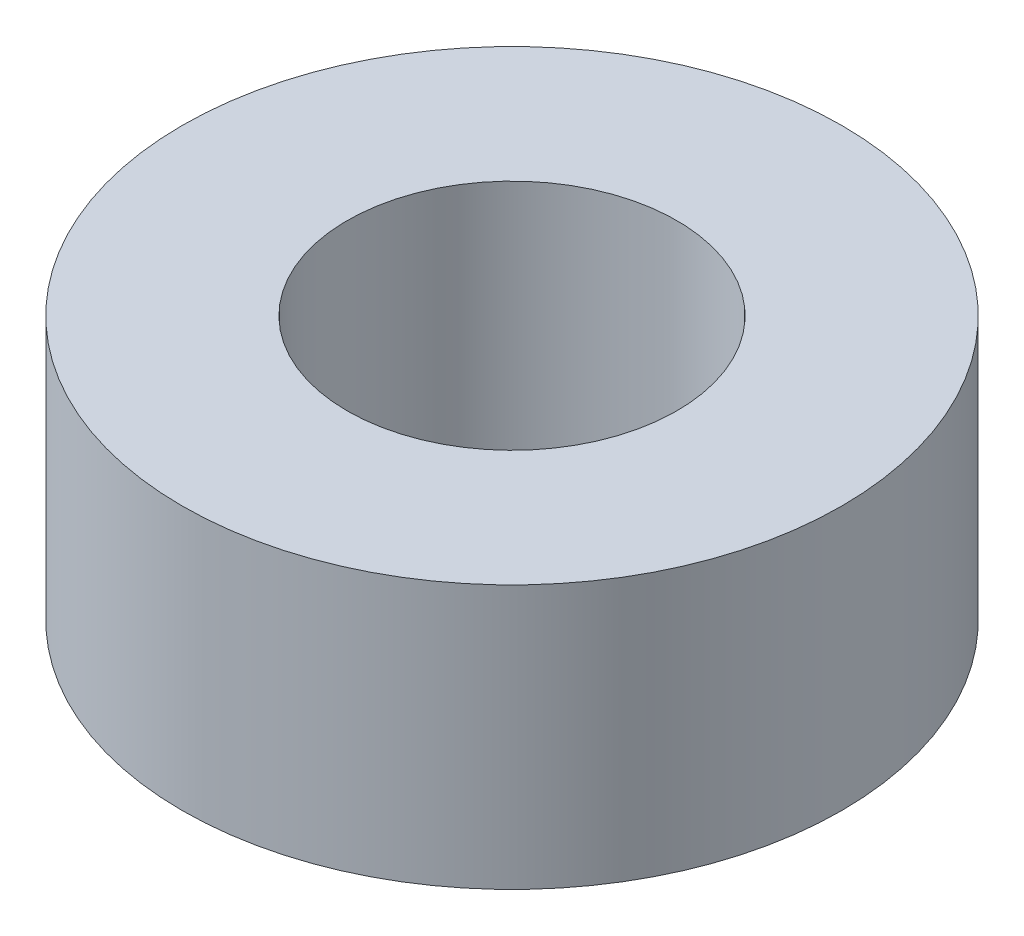
ISO-10303-21;
HEADER;
FILE_DESCRIPTION(('STEP AP214'),'2;1');
FILE_NAME('part.step','',(''),(''),'','','');
FILE_SCHEMA(('AUTOMOTIVE_DESIGN { 1 0 10303 214 1 1 1 1 }'));
ENDSEC;
DATA;
#1=APPLICATION_CONTEXT('core data for automotive mechanical design processes');
#2=APPLICATION_PROTOCOL_DEFINITION('international standard','automotive_design',2000,#1);
#3=PRODUCT_CONTEXT('',#1,'mechanical');
#4=PRODUCT('Part','Part','',(#3));
#5=PRODUCT_RELATED_PRODUCT_CATEGORY('part','',(#4));
#6=PRODUCT_DEFINITION_FORMATION('','',#4);
#7=PRODUCT_DEFINITION_CONTEXT('part definition',#1,'design');
#8=PRODUCT_DEFINITION('design','',#6,#7);
#9=PRODUCT_DEFINITION_SHAPE('','',#8);
#10=(LENGTH_UNIT() NAMED_UNIT(*) SI_UNIT(.MILLI.,.METRE.));
#11=(NAMED_UNIT(*) PLANE_ANGLE_UNIT() SI_UNIT($,.RADIAN.));
#12=(NAMED_UNIT(*) SI_UNIT($,.STERADIAN.) SOLID_ANGLE_UNIT());
#13=UNCERTAINTY_MEASURE_WITH_UNIT(LENGTH_MEASURE(1.E-05),#10,'distance_accuracy_value','');
#14=(GEOMETRIC_REPRESENTATION_CONTEXT(3) GLOBAL_UNCERTAINTY_ASSIGNED_CONTEXT((#13)) GLOBAL_UNIT_ASSIGNED_CONTEXT((#10,
#11,#12)) REPRESENTATION_CONTEXT('',''));
#15=CARTESIAN_POINT('',(0.,0.,0.));
#16=DIRECTION('',(0.,0.,1.));
#17=DIRECTION('',(1.,0.,0.));
#18=AXIS2_PLACEMENT_3D('',#15,#16,#17);
#19=CARTESIAN_POINT('',(0.,4.,0.));
#20=DIRECTION('',(0.,1.,0.));
#21=DIRECTION('',(0.,0.,1.));
#22=AXIS2_PLACEMENT_3D('',#19,#20,#21);
#23=PLANE('',#22);
#24=CARTESIAN_POINT('',(0.,4.,0.));
#25=DIRECTION('',(0.,1.,0.));
#26=DIRECTION('',(0.,0.,1.));
#27=AXIS2_PLACEMENT_3D('',#24,#25,#26);
#28=CIRCLE('',#27,5.);
#29=CARTESIAN_POINT('',(0.,4.,5.));
#30=VERTEX_POINT('',#29);
#31=EDGE_CURVE('E10',#30,#30,#28,.T.);
#32=ORIENTED_EDGE('',*,*,#31,.T.);
#33=EDGE_LOOP('',(#32));
#34=FACE_BOUND('',#33,.T.);
#35=CARTESIAN_POINT('',(0.,4.,0.));
#36=DIRECTION('',(0.,1.,0.));
#37=DIRECTION('',(0.,0.,1.));
#38=AXIS2_PLACEMENT_3D('',#35,#36,#37);
#39=CIRCLE('',#38,2.5);
#40=CARTESIAN_POINT('',(0.,4.,2.5));
#41=VERTEX_POINT('',#40);
#42=EDGE_CURVE('E50',#41,#41,#39,.T.);
#43=ORIENTED_EDGE('',*,*,#42,.F.);
#44=EDGE_LOOP('',(#43));
#45=FACE_BOUND('',#44,.T.);
#46=ADVANCED_FACE('F37',(#34,#45),#23,.T.);
#47=CARTESIAN_POINT('',(0.,0.,0.));
#48=DIRECTION('',(0.,1.,0.));
#49=DIRECTION('',(0.,0.,1.));
#50=AXIS2_PLACEMENT_3D('',#47,#48,#49);
#51=PLANE('',#50);
#52=CARTESIAN_POINT('',(0.,0.,0.));
#53=DIRECTION('',(0.,1.,0.));
#54=DIRECTION('',(0.,0.,1.));
#55=AXIS2_PLACEMENT_3D('',#52,#53,#54);
#56=CIRCLE('',#55,5.);
#57=CARTESIAN_POINT('',(0.,0.,5.));
#58=VERTEX_POINT('',#57);
#59=EDGE_CURVE('E41',#58,#58,#56,.T.);
#60=ORIENTED_EDGE('',*,*,#59,.F.);
#61=EDGE_LOOP('',(#60));
#62=FACE_BOUND('',#61,.T.);
#63=CARTESIAN_POINT('',(0.,0.,0.));
#64=DIRECTION('',(0.,1.,0.));
#65=DIRECTION('',(0.,0.,1.));
#66=AXIS2_PLACEMENT_3D('',#63,#64,#65);
#67=CIRCLE('',#66,2.5);
#68=CARTESIAN_POINT('',(0.,0.,2.5));
#69=VERTEX_POINT('',#68);
#70=EDGE_CURVE('E52',#69,#69,#67,.T.);
#71=ORIENTED_EDGE('',*,*,#70,.T.);
#72=EDGE_LOOP('',(#71));
#73=FACE_BOUND('',#72,.T.);
#74=ADVANCED_FACE('F64',(#62,#73),#51,.F.);
#75=CARTESIAN_POINT('',(0.,4.,0.));
#76=DIRECTION('',(0.,-1.,0.));
#77=DIRECTION('',(0.,0.,-1.));
#78=AXIS2_PLACEMENT_3D('',#75,#76,#77);
#79=CYLINDRICAL_SURFACE('',#78,5.);
#80=ORIENTED_EDGE('',*,*,#31,.F.);
#81=EDGE_LOOP('',(#80));
#82=FACE_BOUND('',#81,.T.);
#83=ORIENTED_EDGE('',*,*,#59,.T.);
#84=EDGE_LOOP('',(#83));
#85=FACE_BOUND('',#84,.T.);
#86=ADVANCED_FACE('F39',(#82,#85),#79,.T.);
#87=CARTESIAN_POINT('',(0.,4.,0.));
#88=DIRECTION('',(0.,-1.,0.));
#89=DIRECTION('',(0.,0.,-1.));
#90=AXIS2_PLACEMENT_3D('',#87,#88,#89);
#91=CYLINDRICAL_SURFACE('',#90,2.5);
#92=ORIENTED_EDGE('',*,*,#42,.T.);
#93=EDGE_LOOP('',(#92));
#94=FACE_BOUND('',#93,.T.);
#95=ORIENTED_EDGE('',*,*,#70,.F.);
#96=EDGE_LOOP('',(#95));
#97=FACE_BOUND('',#96,.T.);
#98=ADVANCED_FACE('F60',(#94,#97),#91,.F.);
#99=CLOSED_SHELL('',(#46,#74,#86,#98));
#100=MANIFOLD_SOLID_BREP('B2',#99);
#101=ADVANCED_BREP_SHAPE_REPRESENTATION('',(#18,#100),#14);
#102=SHAPE_DEFINITION_REPRESENTATION(#9,#101);
ENDSEC;
END-ISO-10303-21;
